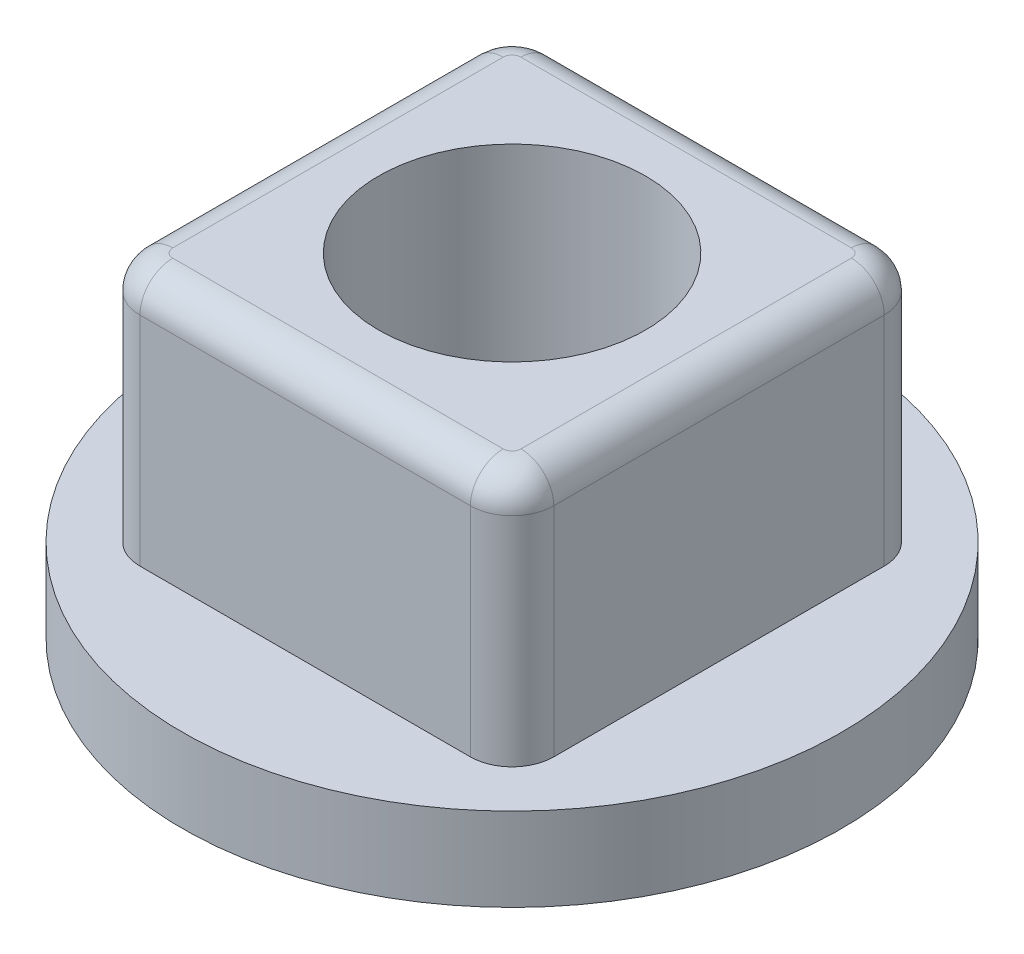
ISO-10303-21;
HEADER;
FILE_DESCRIPTION(('STEP AP214'),'2;1');
FILE_NAME('part.step','',(''),(''),'','','');
FILE_SCHEMA(('AUTOMOTIVE_DESIGN { 1 0 10303 214 1 1 1 1 }'));
ENDSEC;
DATA;
#1=APPLICATION_CONTEXT('core data for automotive mechanical design processes');
#2=APPLICATION_PROTOCOL_DEFINITION('international standard','automotive_design',2000,#1);
#3=PRODUCT_CONTEXT('',#1,'mechanical');
#4=PRODUCT('Part','Part','',(#3));
#5=PRODUCT_RELATED_PRODUCT_CATEGORY('part','',(#4));
#6=PRODUCT_DEFINITION_FORMATION('','',#4);
#7=PRODUCT_DEFINITION_CONTEXT('part definition',#1,'design');
#8=PRODUCT_DEFINITION('design','',#6,#7);
#9=PRODUCT_DEFINITION_SHAPE('','',#8);
#10=(LENGTH_UNIT() NAMED_UNIT(*) SI_UNIT(.MILLI.,.METRE.));
#11=(NAMED_UNIT(*) PLANE_ANGLE_UNIT() SI_UNIT($,.RADIAN.));
#12=(NAMED_UNIT(*) SI_UNIT($,.STERADIAN.) SOLID_ANGLE_UNIT());
#13=UNCERTAINTY_MEASURE_WITH_UNIT(LENGTH_MEASURE(1.E-05),#10,'distance_accuracy_value','');
#14=(GEOMETRIC_REPRESENTATION_CONTEXT(3) GLOBAL_UNCERTAINTY_ASSIGNED_CONTEXT((#13)) GLOBAL_UNIT_ASSIGNED_CONTEXT((#10,
#11,#12)) REPRESENTATION_CONTEXT('',''));
#15=CARTESIAN_POINT('',(0.,0.,0.));
#16=DIRECTION('',(0.,0.,1.));
#17=DIRECTION('',(1.,0.,0.));
#18=AXIS2_PLACEMENT_3D('',#15,#16,#17);
#19=CARTESIAN_POINT('',(-2.5146,5.08,2.5146));
#20=DIRECTION('',(0.,-1.,0.));
#21=DIRECTION('',(0.,0.,-1.));
#22=AXIS2_PLACEMENT_3D('',#19,#20,#21);
#23=CYLINDRICAL_SURFACE('',#22,0.635);
#24=DIRECTION('',(0.,1.,0.));
#25=VECTOR('',#24,1.);
#26=CARTESIAN_POINT('',(-3.1496,5.08,2.51459999999995));
#27=LINE('',#26,#25);
#28=CARTESIAN_POINT('',(-3.14960000000036,4.58,2.51460000000302));
#29=VERTEX_POINT('',#28);
#30=CARTESIAN_POINT('',(-3.1496,1.27,2.51459999999997));
#31=VERTEX_POINT('',#30);
#32=EDGE_CURVE('E67',#29,#31,#27,.F.);
#33=ORIENTED_EDGE('',*,*,#32,.T.);
#34=CARTESIAN_POINT('',(-2.5146,1.27,2.5146));
#35=DIRECTION('',(0.,-1.,0.));
#36=DIRECTION('',(0.,0.,-1.));
#37=AXIS2_PLACEMENT_3D('',#34,#35,#36);
#38=CIRCLE('',#37,0.635);
#39=CARTESIAN_POINT('',(-2.5146,1.27,3.1496));
#40=VERTEX_POINT('',#39);
#41=EDGE_CURVE('E19',#31,#40,#38,.F.);
#42=ORIENTED_EDGE('',*,*,#41,.T.);
#43=DIRECTION('',(0.,1.,0.));
#44=VECTOR('',#43,1.);
#45=CARTESIAN_POINT('',(-2.5146,5.08,3.1496));
#46=LINE('',#45,#44);
#47=CARTESIAN_POINT('',(-2.5146,4.58,3.14959999999967));
#48=VERTEX_POINT('',#47);
#49=EDGE_CURVE('E64',#40,#48,#46,.T.);
#50=ORIENTED_EDGE('',*,*,#49,.T.);
#51=CARTESIAN_POINT('',(-2.51460000000003,4.58000000000001,2.51459999999865));
#52=DIRECTION('',(0.,-1.,0.));
#53=DIRECTION('',(0.,0.,-1.));
#54=AXIS2_PLACEMENT_3D('',#51,#52,#53);
#55=CIRCLE('',#54,0.635000000000685);
#56=EDGE_CURVE('E230',#29,#48,#55,.F.);
#57=ORIENTED_EDGE('',*,*,#56,.F.);
#58=EDGE_LOOP('',(#33,#42,#50,#57));
#59=FACE_BOUND('',#58,.T.);
#60=ADVANCED_FACE('F16',(#59),#23,.T.);
#61=CARTESIAN_POINT('',(-2.5146,5.08,-2.5146));
#62=DIRECTION('',(0.,-1.,0.));
#63=DIRECTION('',(0.,0.,-1.));
#64=AXIS2_PLACEMENT_3D('',#61,#62,#63);
#65=CYLINDRICAL_SURFACE('',#64,0.635);
#66=DIRECTION('',(0.,1.,0.));
#67=VECTOR('',#66,1.);
#68=CARTESIAN_POINT('',(-2.51459999999995,5.08,-3.1496));
#69=LINE('',#68,#67);
#70=CARTESIAN_POINT('',(-2.51460000000237,4.58000000000076,-3.1496));
#71=VERTEX_POINT('',#70);
#72=CARTESIAN_POINT('',(-2.51459999999997,1.27,-3.1496));
#73=VERTEX_POINT('',#72);
#74=EDGE_CURVE('E186',#71,#73,#69,.F.);
#75=ORIENTED_EDGE('',*,*,#74,.T.);
#76=CARTESIAN_POINT('',(-2.5146,1.27,-2.5146));
#77=DIRECTION('',(0.,-1.,0.));
#78=DIRECTION('',(0.,0.,-1.));
#79=AXIS2_PLACEMENT_3D('',#76,#77,#78);
#80=CIRCLE('',#79,0.635);
#81=CARTESIAN_POINT('',(-3.1496,1.27,-2.5146));
#82=VERTEX_POINT('',#81);
#83=EDGE_CURVE('E69',#73,#82,#80,.F.);
#84=ORIENTED_EDGE('',*,*,#83,.T.);
#85=DIRECTION('',(0.,1.,0.));
#86=VECTOR('',#85,1.);
#87=CARTESIAN_POINT('',(-3.1496,5.08,-2.5146));
#88=LINE('',#87,#86);
#89=CARTESIAN_POINT('',(-3.14959999999983,4.58,-2.5146));
#90=VERTEX_POINT('',#89);
#91=EDGE_CURVE('E199',#82,#90,#88,.T.);
#92=ORIENTED_EDGE('',*,*,#91,.T.);
#93=CARTESIAN_POINT('',(-2.51459999999865,4.58000000000001,-2.51460000000003));
#94=DIRECTION('',(0.,-1.,0.));
#95=DIRECTION('',(1.,0.,0.));
#96=AXIS2_PLACEMENT_3D('',#93,#94,#95);
#97=CIRCLE('',#96,0.635000000000685);
#98=EDGE_CURVE('E240',#71,#90,#97,.F.);
#99=ORIENTED_EDGE('',*,*,#98,.F.);
#100=EDGE_LOOP('',(#75,#84,#92,#99));
#101=FACE_BOUND('',#100,.T.);
#102=ADVANCED_FACE('F367',(#101),#65,.T.);
#103=CARTESIAN_POINT('',(2.5146,5.08,2.5146));
#104=DIRECTION('',(0.,-1.,0.));
#105=DIRECTION('',(0.,0.,-1.));
#106=AXIS2_PLACEMENT_3D('',#103,#104,#105);
#107=CYLINDRICAL_SURFACE('',#106,0.635);
#108=DIRECTION('',(0.,1.,0.));
#109=VECTOR('',#108,1.);
#110=CARTESIAN_POINT('',(2.51459999999995,5.08,3.1496));
#111=LINE('',#110,#109);
#112=CARTESIAN_POINT('',(2.51460000000302,4.58,3.14960000000036));
#113=VERTEX_POINT('',#112);
#114=CARTESIAN_POINT('',(2.51459999999997,1.27,3.1496));
#115=VERTEX_POINT('',#114);
#116=EDGE_CURVE('E202',#113,#115,#111,.F.);
#117=ORIENTED_EDGE('',*,*,#116,.T.);
#118=CARTESIAN_POINT('',(2.5146,1.27,2.5146));
#119=DIRECTION('',(0.,-1.,0.));
#120=DIRECTION('',(0.,0.,-1.));
#121=AXIS2_PLACEMENT_3D('',#118,#119,#120);
#122=CIRCLE('',#121,0.635);
#123=CARTESIAN_POINT('',(3.1496,1.27,2.5146));
#124=VERTEX_POINT('',#123);
#125=EDGE_CURVE('E81',#115,#124,#122,.F.);
#126=ORIENTED_EDGE('',*,*,#125,.T.);
#127=DIRECTION('',(0.,1.,0.));
#128=VECTOR('',#127,1.);
#129=CARTESIAN_POINT('',(3.1496,5.08,2.5146));
#130=LINE('',#129,#128);
#131=CARTESIAN_POINT('',(3.14959999999983,4.58,2.51460000000015));
#132=VERTEX_POINT('',#131);
#133=EDGE_CURVE('E183',#124,#132,#130,.T.);
#134=ORIENTED_EDGE('',*,*,#133,.T.);
#135=CARTESIAN_POINT('',(2.51459999999865,4.58000000000001,2.51460000000003));
#136=DIRECTION('',(0.,-1.,0.));
#137=DIRECTION('',(1.,0.,0.));
#138=AXIS2_PLACEMENT_3D('',#135,#136,#137);
#139=CIRCLE('',#138,0.635000000000685);
#140=EDGE_CURVE('E299',#113,#132,#139,.F.);
#141=ORIENTED_EDGE('',*,*,#140,.F.);
#142=EDGE_LOOP('',(#117,#126,#134,#141));
#143=FACE_BOUND('',#142,.T.);
#144=ADVANCED_FACE('F398',(#143),#107,.T.);
#145=CARTESIAN_POINT('',(2.5146,5.08,-2.5146));
#146=DIRECTION('',(0.,-1.,0.));
#147=DIRECTION('',(0.,0.,-1.));
#148=AXIS2_PLACEMENT_3D('',#145,#146,#147);
#149=CYLINDRICAL_SURFACE('',#148,0.635);
#150=DIRECTION('',(0.,1.,0.));
#151=VECTOR('',#150,1.);
#152=CARTESIAN_POINT('',(3.1496,5.08,-2.51459999999997));
#153=LINE('',#152,#151);
#154=CARTESIAN_POINT('',(3.14960000000036,4.58,-2.51460000000303));
#155=VERTEX_POINT('',#154);
#156=CARTESIAN_POINT('',(3.1496,1.27,-2.51459999999999));
#157=VERTEX_POINT('',#156);
#158=EDGE_CURVE('E170',#155,#157,#153,.F.);
#159=ORIENTED_EDGE('',*,*,#158,.T.);
#160=CARTESIAN_POINT('',(2.5146,1.27,-2.5146));
#161=DIRECTION('',(0.,-1.,0.));
#162=DIRECTION('',(0.,0.,-1.));
#163=AXIS2_PLACEMENT_3D('',#160,#161,#162);
#164=CIRCLE('',#163,0.635);
#165=CARTESIAN_POINT('',(2.5146,1.27,-3.1496));
#166=VERTEX_POINT('',#165);
#167=EDGE_CURVE('E34',#157,#166,#164,.F.);
#168=ORIENTED_EDGE('',*,*,#167,.T.);
#169=DIRECTION('',(0.,1.,0.));
#170=VECTOR('',#169,1.);
#171=CARTESIAN_POINT('',(2.5146,5.08,-3.1496));
#172=LINE('',#171,#170);
#173=CARTESIAN_POINT('',(2.51460000000001,4.58,-3.14959999999983));
#174=VERTEX_POINT('',#173);
#175=EDGE_CURVE('E189',#166,#174,#172,.T.);
#176=ORIENTED_EDGE('',*,*,#175,.T.);
#177=CARTESIAN_POINT('',(2.51460000000003,4.58000000000001,-2.51459999999865));
#178=DIRECTION('',(0.,-1.,0.));
#179=DIRECTION('',(0.,0.,-1.));
#180=AXIS2_PLACEMENT_3D('',#177,#178,#179);
#181=CIRCLE('',#180,0.635000000000685);
#182=EDGE_CURVE('E269',#155,#174,#181,.F.);
#183=ORIENTED_EDGE('',*,*,#182,.F.);
#184=EDGE_LOOP('',(#159,#168,#176,#183));
#185=FACE_BOUND('',#184,.T.);
#186=ADVANCED_FACE('F411',(#185),#149,.T.);
#187=CARTESIAN_POINT('',(2.538898108304,4.58,2.6496));
#188=DIRECTION('',(-1.,0.,0.));
#189=DIRECTION('',(0.,0.,1.));
#190=AXIS2_PLACEMENT_3D('',#187,#188,#189);
#191=CYLINDRICAL_SURFACE('',#190,0.5);
#192=CARTESIAN_POINT('',(2.51460000000023,4.58000000000151,2.64960000000213));
#193=DIRECTION('',(-1.,0.,1.17253486400112E-11));
#194=DIRECTION('',(1.17253486400112E-11,0.,1.));
#195=AXIS2_PLACEMENT_3D('',#192,#193,#194);
#196=CIRCLE('',#195,0.499999999998586);
#197=CARTESIAN_POINT('',(2.51460000000024,5.08000000000005,2.64959999798593));
#198=VERTEX_POINT('',#197);
#199=EDGE_CURVE('E169',#198,#113,#196,.F.);
#200=ORIENTED_EDGE('',*,*,#199,.F.);
#201=DIRECTION('',(1.,0.,0.));
#202=VECTOR('',#201,1.);
#203=CARTESIAN_POINT('',(-3.1496,5.08,2.6496));
#204=LINE('',#203,#202);
#205=CARTESIAN_POINT('',(-2.51460000000002,5.08000000000005,2.64960000000019));
#206=VERTEX_POINT('',#205);
#207=EDGE_CURVE('E156',#206,#198,#204,.T.);
#208=ORIENTED_EDGE('',*,*,#207,.F.);
#209=CARTESIAN_POINT('',(-2.51460000000002,4.58000000000152,2.64960000000074));
#210=DIRECTION('',(-1.,0.,0.));
#211=DIRECTION('',(0.,0.,1.));
#212=AXIS2_PLACEMENT_3D('',#209,#210,#211);
#213=CIRCLE('',#212,0.499999999998586);
#214=EDGE_CURVE('E78',#48,#206,#213,.T.);
#215=ORIENTED_EDGE('',*,*,#214,.F.);
#216=DIRECTION('',(-1.,0.,0.));
#217=VECTOR('',#216,1.);
#218=CARTESIAN_POINT('',(-3.1496,4.58,3.1496));
#219=LINE('',#218,#217);
#220=EDGE_CURVE('E76',#48,#113,#219,.F.);
#221=ORIENTED_EDGE('',*,*,#220,.T.);
#222=EDGE_LOOP('',(#200,#208,#215,#221));
#223=FACE_BOUND('',#222,.T.);
#224=ADVANCED_FACE('F167',(#223),#191,.T.);
#225=CARTESIAN_POINT('',(2.64960000000074,4.58000000000151,2.51460000000003));
#226=DIRECTION('',(0.,0.,1.));
#227=DIRECTION('',(1.,0.,0.));
#228=AXIS2_PLACEMENT_3D('',#225,#226,#227);
#229=CIRCLE('',#228,0.499999999998586);
#230=TRIMMED_CURVE('',#229,(PARAMETER_VALUE(-1.84418935826752)),
(PARAMETER_VALUE(1.84418935826752)),.T.,.PARAMETER.);
#231=CARTESIAN_POINT('',(2.51459999999865,4.58000000000152,2.51460000000003));
#232=DIRECTION('',(0.,-1.,0.));
#233=AXIS1_PLACEMENT('',#231,#232);
#234=SURFACE_OF_REVOLUTION('',#230,#233);
#235=CARTESIAN_POINT('',(2.6496,4.58,2.51460000000056));
#236=DIRECTION('',(0.,0.,1.));
#237=DIRECTION('',(1.,0.,0.));
#238=AXIS2_PLACEMENT_3D('',#235,#236,#237);
#239=CIRCLE('',#238,0.5);
#240=CARTESIAN_POINT('',(2.64959999764931,5.08000000000002,2.51460000000043));
#241=VERTEX_POINT('',#240);
#242=EDGE_CURVE('E294',#241,#132,#239,.F.);
#243=ORIENTED_EDGE('',*,*,#242,.F.);
#244=CARTESIAN_POINT('',(2.51459999999865,5.0800000000001,2.51460000000004));
#245=DIRECTION('',(0.,-1.,0.));
#246=DIRECTION('',(1.,0.,0.));
#247=AXIS2_PLACEMENT_3D('',#244,#245,#246);
#248=CIRCLE('',#247,0.134999998658406);
#249=EDGE_CURVE('E99',#198,#241,#248,.F.);
#250=ORIENTED_EDGE('',*,*,#249,.F.);
#251=ORIENTED_EDGE('',*,*,#199,.T.);
#252=ORIENTED_EDGE('',*,*,#140,.T.);
#253=EDGE_LOOP('',(#243,#250,#251,#252));
#254=FACE_BOUND('',#253,.T.);
#255=ADVANCED_FACE('F305',(#254),#234,.F.);
#256=CARTESIAN_POINT('',(2.6496,4.58,-2.538898108304));
#257=DIRECTION('',(0.,0.,1.));
#258=DIRECTION('',(1.,0.,0.));
#259=AXIS2_PLACEMENT_3D('',#256,#257,#258);
#260=CYLINDRICAL_SURFACE('',#259,0.5);
#261=CARTESIAN_POINT('',(2.64960000000213,4.58000000000151,-2.51460000000023));
#262=DIRECTION('',(1.17253486400112E-11,0.,1.));
#263=DIRECTION('',(1.,0.,-1.17253486400112E-11));
#264=AXIS2_PLACEMENT_3D('',#261,#262,#263);
#265=CIRCLE('',#264,0.499999999998586);
#266=CARTESIAN_POINT('',(2.64959999865759,5.08000000000005,-2.51460000000024));
#267=VERTEX_POINT('',#266);
#268=EDGE_CURVE('E286',#267,#155,#265,.F.);
#269=ORIENTED_EDGE('',*,*,#268,.F.);
#270=DIRECTION('',(0.,0.,1.));
#271=VECTOR('',#270,1.);
#272=CARTESIAN_POINT('',(2.64959999731337,5.08,3.1496));
#273=LINE('',#272,#271);
#274=EDGE_CURVE('E172',#241,#267,#273,.F.);
#275=ORIENTED_EDGE('',*,*,#274,.F.);
#276=ORIENTED_EDGE('',*,*,#242,.T.);
#277=DIRECTION('',(0.,0.,1.));
#278=VECTOR('',#277,1.);
#279=CARTESIAN_POINT('',(3.1496,4.58,-3.1496));
#280=LINE('',#279,#278);
#281=EDGE_CURVE('E173',#132,#155,#280,.F.);
#282=ORIENTED_EDGE('',*,*,#281,.T.);
#283=EDGE_LOOP('',(#269,#275,#276,#282));
#284=FACE_BOUND('',#283,.T.);
#285=ADVANCED_FACE('F280',(#284),#260,.T.);
#286=CARTESIAN_POINT('',(2.51460000000003,4.58000000000151,-2.64960000000074));
#287=DIRECTION('',(1.,0.,0.));
#288=DIRECTION('',(0.,0.,-1.));
#289=AXIS2_PLACEMENT_3D('',#286,#287,#288);
#290=CIRCLE('',#289,0.499999999998586);
#291=TRIMMED_CURVE('',#290,(PARAMETER_VALUE(-1.84418935826752)),
(PARAMETER_VALUE(1.84418935826752)),.T.,.PARAMETER.);
#292=CARTESIAN_POINT('',(2.51460000000003,4.58000000000152,-2.51459999999865));
#293=DIRECTION('',(0.,-1.,0.));
#294=AXIS1_PLACEMENT('',#292,#293);
#295=SURFACE_OF_REVOLUTION('',#291,#294);
#296=CARTESIAN_POINT('',(2.5146,4.58,-2.6496));
#297=DIRECTION('',(1.,0.,0.));
#298=DIRECTION('',(0.,0.,-1.));
#299=AXIS2_PLACEMENT_3D('',#296,#297,#298);
#300=CIRCLE('',#299,0.5);
#301=CARTESIAN_POINT('',(2.51460000000001,5.08000000000002,-2.64959999932845));
#302=VERTEX_POINT('',#301);
#303=EDGE_CURVE('E264',#302,#174,#300,.F.);
#304=ORIENTED_EDGE('',*,*,#303,.F.);
#305=CARTESIAN_POINT('',(2.51460000000004,5.0800000000001,-2.51459999999865));
#306=DIRECTION('',(0.,-1.,0.));
#307=DIRECTION('',(0.,0.,-1.));
#308=AXIS2_PLACEMENT_3D('',#305,#306,#307);
#309=CIRCLE('',#308,0.135000000001723);
#310=EDGE_CURVE('E418',#267,#302,#309,.F.);
#311=ORIENTED_EDGE('',*,*,#310,.F.);
#312=ORIENTED_EDGE('',*,*,#268,.T.);
#313=ORIENTED_EDGE('',*,*,#182,.T.);
#314=EDGE_LOOP('',(#304,#311,#312,#313));
#315=FACE_BOUND('',#314,.T.);
#316=ADVANCED_FACE('F276',(#315),#295,.F.);
#317=CARTESIAN_POINT('',(-2.538898108304,4.58,-2.6496));
#318=DIRECTION('',(1.,0.,0.));
#319=DIRECTION('',(0.,0.,-1.));
#320=AXIS2_PLACEMENT_3D('',#317,#318,#319);
#321=CYLINDRICAL_SURFACE('',#320,0.5);
#322=CARTESIAN_POINT('',(-2.51460000000023,4.58000000000152,-2.64960000000213));
#323=DIRECTION('',(1.,0.,-1.17259151939009E-11));
#324=DIRECTION('',(-1.17259151939009E-11,0.,-1.));
#325=AXIS2_PLACEMENT_3D('',#322,#323,#324);
#326=CIRCLE('',#325,0.499999999998586);
#327=CARTESIAN_POINT('',(-2.51460000000024,5.08000000000005,-2.64959999865759));
#328=VERTEX_POINT('',#327);
#329=EDGE_CURVE('E256',#328,#71,#326,.F.);
#330=ORIENTED_EDGE('',*,*,#329,.F.);
#331=DIRECTION('',(1.,0.,0.));
#332=VECTOR('',#331,1.);
#333=CARTESIAN_POINT('',(-3.1496,5.08,-2.6496));
#334=LINE('',#333,#332);
#335=EDGE_CURVE('E417',#302,#328,#334,.F.);
#336=ORIENTED_EDGE('',*,*,#335,.F.);
#337=ORIENTED_EDGE('',*,*,#303,.T.);
#338=DIRECTION('',(1.,0.,0.));
#339=VECTOR('',#338,1.);
#340=CARTESIAN_POINT('',(-3.1496,4.58,-3.1496));
#341=LINE('',#340,#339);
#342=EDGE_CURVE('E192',#174,#71,#341,.F.);
#343=ORIENTED_EDGE('',*,*,#342,.T.);
#344=EDGE_LOOP('',(#330,#336,#337,#343));
#345=FACE_BOUND('',#344,.T.);
#346=ADVANCED_FACE('F250',(#345),#321,.T.);
#347=CARTESIAN_POINT('',(-2.37959999999655,4.58000000000152,-2.51460000000003));
#348=DIRECTION('',(0.,0.,1.));
#349=DIRECTION('',(1.,0.,0.));
#350=AXIS2_PLACEMENT_3D('',#347,#348,#349);
#351=CIRCLE('',#350,0.499999999998586);
#352=TRIMMED_CURVE('',#351,(PARAMETER_VALUE(-1.84418935826752)),
(PARAMETER_VALUE(1.84418935826752)),.T.,.PARAMETER.);
#353=CARTESIAN_POINT('',(-2.51459999999865,4.58000000000152,-2.51460000000003));
#354=DIRECTION('',(0.,-1.,0.));
#355=AXIS1_PLACEMENT('',#353,#354);
#356=SURFACE_OF_REVOLUTION('',#352,#355);
#357=CARTESIAN_POINT('',(-2.6496,4.58,-2.5146));
#358=DIRECTION('',(0.,0.,-1.));
#359=DIRECTION('',(-1.,0.,0.));
#360=AXIS2_PLACEMENT_3D('',#357,#358,#359);
#361=CIRCLE('',#360,0.5);
#362=CARTESIAN_POINT('',(-2.64959999932845,5.08000000000002,-2.51460000000001));
#363=VERTEX_POINT('',#362);
#364=EDGE_CURVE('E235',#363,#90,#361,.F.);
#365=ORIENTED_EDGE('',*,*,#364,.F.);
#366=CARTESIAN_POINT('',(-2.51459999999865,5.0800000000001,-2.51460000000004));
#367=DIRECTION('',(0.,-1.,0.));
#368=DIRECTION('',(-1.,0.,0.));
#369=AXIS2_PLACEMENT_3D('',#366,#367,#368);
#370=CIRCLE('',#369,0.135000000001722);
#371=EDGE_CURVE('E142',#328,#363,#370,.F.);
#372=ORIENTED_EDGE('',*,*,#371,.F.);
#373=ORIENTED_EDGE('',*,*,#329,.T.);
#374=ORIENTED_EDGE('',*,*,#98,.T.);
#375=EDGE_LOOP('',(#365,#372,#373,#374));
#376=FACE_BOUND('',#375,.T.);
#377=ADVANCED_FACE('F246',(#376),#356,.F.);
#378=CARTESIAN_POINT('',(-2.6496,4.58,2.538898108304));
#379=DIRECTION('',(0.,0.,-1.));
#380=DIRECTION('',(-1.,0.,0.));
#381=AXIS2_PLACEMENT_3D('',#378,#379,#380);
#382=CYLINDRICAL_SURFACE('',#381,0.5);
#383=CARTESIAN_POINT('',(-2.64960000000213,4.58000000000152,2.51460000000023));
#384=DIRECTION('',(-1.17259151939009E-11,0.,-1.));
#385=DIRECTION('',(-1.,0.,1.17259151939009E-11));
#386=AXIS2_PLACEMENT_3D('',#383,#384,#385);
#387=CIRCLE('',#386,0.499999999998586);
#388=CARTESIAN_POINT('',(-2.64959999865759,5.08000000000005,2.51460000000024));
#389=VERTEX_POINT('',#388);
#390=EDGE_CURVE('E233',#389,#29,#387,.F.);
#391=ORIENTED_EDGE('',*,*,#390,.F.);
#392=DIRECTION('',(0.,0.,1.));
#393=VECTOR('',#392,1.);
#394=CARTESIAN_POINT('',(-2.6496,5.08,3.1496));
#395=LINE('',#394,#393);
#396=EDGE_CURVE('E89',#363,#389,#395,.T.);
#397=ORIENTED_EDGE('',*,*,#396,.F.);
#398=ORIENTED_EDGE('',*,*,#364,.T.);
#399=DIRECTION('',(0.,0.,-1.));
#400=VECTOR('',#399,1.);
#401=CARTESIAN_POINT('',(-3.1496,4.58,-3.1496));
#402=LINE('',#401,#400);
#403=EDGE_CURVE('E196',#90,#29,#402,.F.);
#404=ORIENTED_EDGE('',*,*,#403,.T.);
#405=EDGE_LOOP('',(#391,#397,#398,#404));
#406=FACE_BOUND('',#405,.T.);
#407=ADVANCED_FACE('F218',(#406),#382,.T.);
#408=CARTESIAN_POINT('',(-2.51460000000003,4.58000000000152,2.37959999999655));
#409=DIRECTION('',(1.,0.,0.));
#410=DIRECTION('',(0.,0.,-1.));
#411=AXIS2_PLACEMENT_3D('',#408,#409,#410);
#412=CIRCLE('',#411,0.499999999998586);
#413=TRIMMED_CURVE('',#412,(PARAMETER_VALUE(-1.84418935826752)),
(PARAMETER_VALUE(1.84418935826752)),.T.,.PARAMETER.);
#414=CARTESIAN_POINT('',(-2.51460000000003,4.58000000000152,2.51459999999865));
#415=DIRECTION('',(0.,-1.,0.));
#416=AXIS1_PLACEMENT('',#414,#415);
#417=SURFACE_OF_REVOLUTION('',#413,#416);
#418=ORIENTED_EDGE('',*,*,#214,.T.);
#419=CARTESIAN_POINT('',(-2.51460000000004,5.0800000000001,2.51459999999865));
#420=DIRECTION('',(0.,-1.,0.));
#421=DIRECTION('',(0.,0.,1.));
#422=AXIS2_PLACEMENT_3D('',#419,#420,#421);
#423=CIRCLE('',#422,0.135000000001722);
#424=EDGE_CURVE('E84',#389,#206,#423,.F.);
#425=ORIENTED_EDGE('',*,*,#424,.F.);
#426=ORIENTED_EDGE('',*,*,#390,.T.);
#427=ORIENTED_EDGE('',*,*,#56,.T.);
#428=EDGE_LOOP('',(#418,#425,#426,#427));
#429=FACE_BOUND('',#428,.T.);
#430=ADVANCED_FACE('F213',(#429),#417,.F.);
#431=CARTESIAN_POINT('',(-3.1496,5.08,3.1496));
#432=DIRECTION('',(0.,0.,-1.));
#433=DIRECTION('',(-1.,0.,0.));
#434=AXIS2_PLACEMENT_3D('',#431,#432,#433);
#435=PLANE('',#434);
#436=ORIENTED_EDGE('',*,*,#116,.F.);
#437=ORIENTED_EDGE('',*,*,#220,.F.);
#438=ORIENTED_EDGE('',*,*,#49,.F.);
#439=DIRECTION('',(1.,0.,0.));
#440=VECTOR('',#439,1.);
#441=CARTESIAN_POINT('',(0.,1.27,3.1496));
#442=LINE('',#441,#440);
#443=EDGE_CURVE('E74',#115,#40,#442,.F.);
#444=ORIENTED_EDGE('',*,*,#443,.F.);
#445=EDGE_LOOP('',(#436,#437,#438,#444));
#446=FACE_BOUND('',#445,.T.);
#447=ADVANCED_FACE('F73',(#446),#435,.F.);
#448=CARTESIAN_POINT('',(-3.1496,5.08,-3.1496));
#449=DIRECTION('',(1.,0.,0.));
#450=DIRECTION('',(0.,0.,-1.));
#451=AXIS2_PLACEMENT_3D('',#448,#449,#450);
#452=PLANE('',#451);
#453=ORIENTED_EDGE('',*,*,#32,.F.);
#454=ORIENTED_EDGE('',*,*,#403,.F.);
#455=ORIENTED_EDGE('',*,*,#91,.F.);
#456=DIRECTION('',(0.,0.,1.));
#457=VECTOR('',#456,1.);
#458=CARTESIAN_POINT('',(-3.1496,1.27,0.));
#459=LINE('',#458,#457);
#460=EDGE_CURVE('E83',#31,#82,#459,.F.);
#461=ORIENTED_EDGE('',*,*,#460,.F.);
#462=EDGE_LOOP('',(#453,#454,#455,#461));
#463=FACE_BOUND('',#462,.T.);
#464=ADVANCED_FACE('F374',(#463),#452,.F.);
#465=CARTESIAN_POINT('',(-3.1496,5.08,-3.1496));
#466=DIRECTION('',(0.,0.,1.));
#467=DIRECTION('',(1.,0.,0.));
#468=AXIS2_PLACEMENT_3D('',#465,#466,#467);
#469=PLANE('',#468);
#470=ORIENTED_EDGE('',*,*,#74,.F.);
#471=ORIENTED_EDGE('',*,*,#342,.F.);
#472=ORIENTED_EDGE('',*,*,#175,.F.);
#473=DIRECTION('',(1.,0.,0.));
#474=VECTOR('',#473,1.);
#475=CARTESIAN_POINT('',(0.,1.27,-3.1496));
#476=LINE('',#475,#474);
#477=EDGE_CURVE('E86',#73,#166,#476,.T.);
#478=ORIENTED_EDGE('',*,*,#477,.F.);
#479=EDGE_LOOP('',(#470,#471,#472,#478));
#480=FACE_BOUND('',#479,.T.);
#481=ADVANCED_FACE('F407',(#480),#469,.F.);
#482=CARTESIAN_POINT('',(3.1496,5.08,-3.1496));
#483=DIRECTION('',(-1.,0.,0.));
#484=DIRECTION('',(0.,0.,1.));
#485=AXIS2_PLACEMENT_3D('',#482,#483,#484);
#486=PLANE('',#485);
#487=ORIENTED_EDGE('',*,*,#158,.F.);
#488=ORIENTED_EDGE('',*,*,#281,.F.);
#489=ORIENTED_EDGE('',*,*,#133,.F.);
#490=DIRECTION('',(0.,0.,1.));
#491=VECTOR('',#490,1.);
#492=CARTESIAN_POINT('',(3.1496,1.27,0.));
#493=LINE('',#492,#491);
#494=EDGE_CURVE('E361',#157,#124,#493,.T.);
#495=ORIENTED_EDGE('',*,*,#494,.F.);
#496=EDGE_LOOP('',(#487,#488,#489,#495));
#497=FACE_BOUND('',#496,.T.);
#498=ADVANCED_FACE('F117',(#497),#486,.F.);
#499=CARTESIAN_POINT('',(-3.1496,5.08,3.1496));
#500=DIRECTION('',(0.,1.,0.));
#501=DIRECTION('',(0.,0.,1.));
#502=AXIS2_PLACEMENT_3D('',#499,#500,#501);
#503=PLANE('',#502);
#504=ORIENTED_EDGE('',*,*,#396,.T.);
#505=ORIENTED_EDGE('',*,*,#424,.T.);
#506=ORIENTED_EDGE('',*,*,#207,.T.);
#507=ORIENTED_EDGE('',*,*,#249,.T.);
#508=ORIENTED_EDGE('',*,*,#274,.T.);
#509=ORIENTED_EDGE('',*,*,#310,.T.);
#510=ORIENTED_EDGE('',*,*,#335,.T.);
#511=ORIENTED_EDGE('',*,*,#371,.T.);
#512=EDGE_LOOP('',(#504,#505,#506,#507,#508,#509,#510,#511));
#513=FACE_BOUND('',#512,.T.);
#514=CARTESIAN_POINT('',(0.,5.08,0.));
#515=DIRECTION('',(0.,-1.,0.));
#516=DIRECTION('',(0.,0.,-1.));
#517=AXIS2_PLACEMENT_3D('',#514,#515,#516);
#518=CIRCLE('',#517,2.032);
#519=CARTESIAN_POINT('',(0.,5.08,-2.032));
#520=VERTEX_POINT('',#519);
#521=EDGE_CURVE('E358',#520,#520,#518,.T.);
#522=ORIENTED_EDGE('',*,*,#521,.T.);
#523=EDGE_LOOP('',(#522));
#524=FACE_BOUND('',#523,.T.);
#525=ADVANCED_FACE('F107',(#513,#524),#503,.T.);
#526=CARTESIAN_POINT('',(0.,1.27,0.));
#527=DIRECTION('',(0.,1.,0.));
#528=DIRECTION('',(0.,0.,1.));
#529=AXIS2_PLACEMENT_3D('',#526,#527,#528);
#530=PLANE('',#529);
#531=CARTESIAN_POINT('',(0.,1.27,0.));
#532=DIRECTION('',(0.,-1.,0.));
#533=DIRECTION('',(0.,0.,-1.));
#534=AXIS2_PLACEMENT_3D('',#531,#532,#533);
#535=CIRCLE('',#534,5.0165);
#536=CARTESIAN_POINT('',(0.,1.27,-5.0165));
#537=VERTEX_POINT('',#536);
#538=EDGE_CURVE('E355',#537,#537,#535,.T.);
#539=ORIENTED_EDGE('',*,*,#538,.F.);
#540=EDGE_LOOP('',(#539));
#541=FACE_BOUND('',#540,.T.);
#542=ORIENTED_EDGE('',*,*,#167,.F.);
#543=ORIENTED_EDGE('',*,*,#494,.T.);
#544=ORIENTED_EDGE('',*,*,#125,.F.);
#545=ORIENTED_EDGE('',*,*,#443,.T.);
#546=ORIENTED_EDGE('',*,*,#41,.F.);
#547=ORIENTED_EDGE('',*,*,#460,.T.);
#548=ORIENTED_EDGE('',*,*,#83,.F.);
#549=ORIENTED_EDGE('',*,*,#477,.T.);
#550=EDGE_LOOP('',(#542,#543,#544,#545,#546,#547,#548,#549));
#551=FACE_BOUND('',#550,.T.);
#552=ADVANCED_FACE('F80',(#541,#551),#530,.T.);
#553=CARTESIAN_POINT('',(0.,0.,0.));
#554=DIRECTION('',(0.,-1.,0.));
#555=DIRECTION('',(0.,0.,-1.));
#556=AXIS2_PLACEMENT_3D('',#553,#554,#555);
#557=CYLINDRICAL_SURFACE('',#556,2.032);
#558=ORIENTED_EDGE('',*,*,#521,.F.);
#559=EDGE_LOOP('',(#558));
#560=FACE_BOUND('',#559,.T.);
#561=CARTESIAN_POINT('',(0.,0.,0.));
#562=DIRECTION('',(0.,-1.,0.));
#563=DIRECTION('',(0.,0.,-1.));
#564=AXIS2_PLACEMENT_3D('',#561,#562,#563);
#565=CIRCLE('',#564,2.032);
#566=CARTESIAN_POINT('',(0.,0.,-2.032));
#567=VERTEX_POINT('',#566);
#568=EDGE_CURVE('E25',#567,#567,#565,.T.);
#569=ORIENTED_EDGE('',*,*,#568,.T.);
#570=EDGE_LOOP('',(#569));
#571=FACE_BOUND('',#570,.T.);
#572=ADVANCED_FACE('F438',(#560,#571),#557,.F.);
#573=CARTESIAN_POINT('',(0.,1.27,0.));
#574=DIRECTION('',(0.,-1.,0.));
#575=DIRECTION('',(0.,0.,-1.));
#576=AXIS2_PLACEMENT_3D('',#573,#574,#575);
#577=CYLINDRICAL_SURFACE('',#576,5.0165);
#578=ORIENTED_EDGE('',*,*,#538,.T.);
#579=EDGE_LOOP('',(#578));
#580=FACE_BOUND('',#579,.T.);
#581=CARTESIAN_POINT('',(0.,0.,0.));
#582=DIRECTION('',(0.,-1.,0.));
#583=DIRECTION('',(0.,0.,-1.));
#584=AXIS2_PLACEMENT_3D('',#581,#582,#583);
#585=CIRCLE('',#584,5.0165);
#586=CARTESIAN_POINT('',(0.,0.,-5.0165));
#587=VERTEX_POINT('',#586);
#588=EDGE_CURVE('E10',#587,#587,#585,.F.);
#589=ORIENTED_EDGE('',*,*,#588,.T.);
#590=EDGE_LOOP('',(#589));
#591=FACE_BOUND('',#590,.T.);
#592=ADVANCED_FACE('F432',(#580,#591),#577,.T.);
#593=CARTESIAN_POINT('',(0.,0.,0.));
#594=DIRECTION('',(0.,1.,0.));
#595=DIRECTION('',(0.,0.,1.));
#596=AXIS2_PLACEMENT_3D('',#593,#594,#595);
#597=PLANE('',#596);
#598=ORIENTED_EDGE('',*,*,#588,.F.);
#599=EDGE_LOOP('',(#598));
#600=FACE_BOUND('',#599,.T.);
#601=ORIENTED_EDGE('',*,*,#568,.F.);
#602=EDGE_LOOP('',(#601));
#603=FACE_BOUND('',#602,.T.);
#604=ADVANCED_FACE('F430',(#600,#603),#597,.F.);
#605=CLOSED_SHELL('',(#60,#102,#144,#186,#224,#255,#285,#316,#346,#377,#407,#430,#447,#464,#481,
#498,#525,#552,#572,#592,#604));
#606=MANIFOLD_SOLID_BREP('B1',#605);
#607=ADVANCED_BREP_SHAPE_REPRESENTATION('',(#18,#606),#14);
#608=SHAPE_DEFINITION_REPRESENTATION(#9,#607);
ENDSEC;
END-ISO-10303-21;
